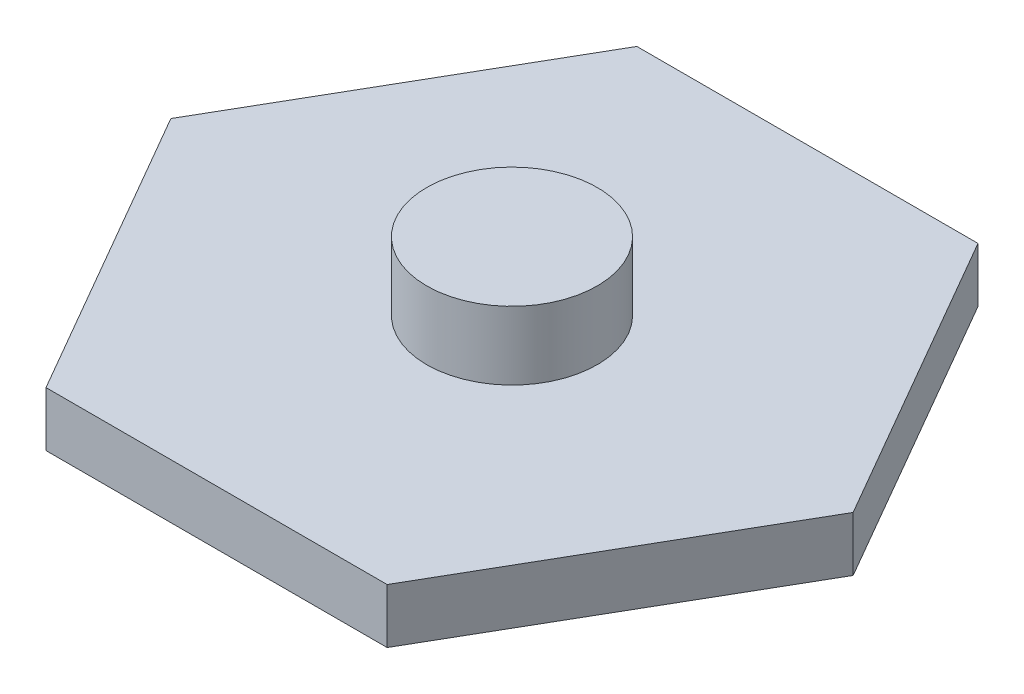
ISO-10303-21;
HEADER;
FILE_DESCRIPTION(('STEP AP214'),'2;1');
FILE_NAME('part.step','',(''),(''),'','','');
FILE_SCHEMA(('AUTOMOTIVE_DESIGN { 1 0 10303 214 1 1 1 1 }'));
ENDSEC;
DATA;
#1=APPLICATION_CONTEXT('core data for automotive mechanical design processes');
#2=APPLICATION_PROTOCOL_DEFINITION('international standard','automotive_design',2000,#1);
#3=PRODUCT_CONTEXT('',#1,'mechanical');
#4=PRODUCT('Part','Part','',(#3));
#5=PRODUCT_RELATED_PRODUCT_CATEGORY('part','',(#4));
#6=PRODUCT_DEFINITION_FORMATION('','',#4);
#7=PRODUCT_DEFINITION_CONTEXT('part definition',#1,'design');
#8=PRODUCT_DEFINITION('design','',#6,#7);
#9=PRODUCT_DEFINITION_SHAPE('','',#8);
#10=(LENGTH_UNIT() NAMED_UNIT(*) SI_UNIT(.MILLI.,.METRE.));
#11=(NAMED_UNIT(*) PLANE_ANGLE_UNIT() SI_UNIT($,.RADIAN.));
#12=(NAMED_UNIT(*) SI_UNIT($,.STERADIAN.) SOLID_ANGLE_UNIT());
#13=UNCERTAINTY_MEASURE_WITH_UNIT(LENGTH_MEASURE(1.E-05),#10,'distance_accuracy_value','');
#14=(GEOMETRIC_REPRESENTATION_CONTEXT(3) GLOBAL_UNCERTAINTY_ASSIGNED_CONTEXT((#13)) GLOBAL_UNIT_ASSIGNED_CONTEXT((#10,
#11,#12)) REPRESENTATION_CONTEXT('',''));
#15=CARTESIAN_POINT('',(0.,0.,0.));
#16=DIRECTION('',(0.,0.,1.));
#17=DIRECTION('',(1.,0.,0.));
#18=AXIS2_PLACEMENT_3D('',#15,#16,#17);
#19=CARTESIAN_POINT('',(5.,1.6,8.66025403784439));
#20=DIRECTION('',(-0.866025403784439,0.,-0.499999999999999));
#21=DIRECTION('',(-0.5,0.,0.866025403784439));
#22=AXIS2_PLACEMENT_3D('',#19,#20,#21);
#23=PLANE('',#22);
#24=DIRECTION('',(0.5,0.,-0.866025403784439));
#25=VECTOR('',#24,1.);
#26=CARTESIAN_POINT('',(5.,0.,8.66025403784439));
#27=LINE('',#26,#25);
#28=CARTESIAN_POINT('',(5.,0.,8.66025403784439));
#29=VERTEX_POINT('',#28);
#30=CARTESIAN_POINT('',(10.,0.,0.));
#31=VERTEX_POINT('',#30);
#32=EDGE_CURVE('E130',#29,#31,#27,.T.);
#33=ORIENTED_EDGE('',*,*,#32,.T.);
#34=DIRECTION('',(0.,-1.,0.));
#35=VECTOR('',#34,1.);
#36=CARTESIAN_POINT('',(10.,1.6,0.));
#37=LINE('',#36,#35);
#38=CARTESIAN_POINT('',(10.,1.6,0.));
#39=VERTEX_POINT('',#38);
#40=EDGE_CURVE('E42',#39,#31,#37,.T.);
#41=ORIENTED_EDGE('',*,*,#40,.F.);
#42=DIRECTION('',(0.5,0.,-0.866025403784439));
#43=VECTOR('',#42,1.);
#44=CARTESIAN_POINT('',(5.,1.6,8.66025403784439));
#45=LINE('',#44,#43);
#46=CARTESIAN_POINT('',(5.,1.6,8.66025403784439));
#47=VERTEX_POINT('',#46);
#48=EDGE_CURVE('E147',#47,#39,#45,.T.);
#49=ORIENTED_EDGE('',*,*,#48,.F.);
#50=DIRECTION('',(0.,-1.,0.));
#51=VECTOR('',#50,1.);
#52=CARTESIAN_POINT('',(5.,1.6,8.66025403784439));
#53=LINE('',#52,#51);
#54=EDGE_CURVE('E126',#47,#29,#53,.T.);
#55=ORIENTED_EDGE('',*,*,#54,.T.);
#56=EDGE_LOOP('',(#33,#41,#49,#55));
#57=FACE_BOUND('',#56,.T.);
#58=ADVANCED_FACE('F39',(#57),#23,.F.);
#59=CARTESIAN_POINT('',(10.,1.6,0.));
#60=DIRECTION('',(-0.866025403784439,0.,0.5));
#61=DIRECTION('',(0.5,0.,0.866025403784439));
#62=AXIS2_PLACEMENT_3D('',#59,#60,#61);
#63=PLANE('',#62);
#64=DIRECTION('',(-0.5,0.,-0.866025403784439));
#65=VECTOR('',#64,1.);
#66=CARTESIAN_POINT('',(10.,0.,0.));
#67=LINE('',#66,#65);
#68=CARTESIAN_POINT('',(5.,0.,-8.66025403784439));
#69=VERTEX_POINT('',#68);
#70=EDGE_CURVE('E134',#31,#69,#67,.T.);
#71=ORIENTED_EDGE('',*,*,#70,.T.);
#72=DIRECTION('',(0.,-1.,0.));
#73=VECTOR('',#72,1.);
#74=CARTESIAN_POINT('',(5.,1.6,-8.66025403784439));
#75=LINE('',#74,#73);
#76=CARTESIAN_POINT('',(5.,1.6,-8.66025403784439));
#77=VERTEX_POINT('',#76);
#78=EDGE_CURVE('E153',#77,#69,#75,.T.);
#79=ORIENTED_EDGE('',*,*,#78,.F.);
#80=DIRECTION('',(-0.5,0.,-0.866025403784439));
#81=VECTOR('',#80,1.);
#82=CARTESIAN_POINT('',(10.,1.6,0.));
#83=LINE('',#82,#81);
#84=EDGE_CURVE('E95',#39,#77,#83,.T.);
#85=ORIENTED_EDGE('',*,*,#84,.F.);
#86=ORIENTED_EDGE('',*,*,#40,.T.);
#87=EDGE_LOOP('',(#71,#79,#85,#86));
#88=FACE_BOUND('',#87,.T.);
#89=ADVANCED_FACE('F160',(#88),#63,.F.);
#90=CARTESIAN_POINT('',(5.,1.6,-8.66025403784439));
#91=DIRECTION('',(0.,0.,1.));
#92=DIRECTION('',(1.,0.,0.));
#93=AXIS2_PLACEMENT_3D('',#90,#91,#92);
#94=PLANE('',#93);
#95=DIRECTION('',(-1.,0.,0.));
#96=VECTOR('',#95,1.);
#97=CARTESIAN_POINT('',(5.,0.,-8.66025403784439));
#98=LINE('',#97,#96);
#99=CARTESIAN_POINT('',(-5.,0.,-8.66025403784439));
#100=VERTEX_POINT('',#99);
#101=EDGE_CURVE('E138',#69,#100,#98,.T.);
#102=ORIENTED_EDGE('',*,*,#101,.T.);
#103=DIRECTION('',(0.,-1.,0.));
#104=VECTOR('',#103,1.);
#105=CARTESIAN_POINT('',(-5.,1.6,-8.66025403784439));
#106=LINE('',#105,#104);
#107=CARTESIAN_POINT('',(-5.,1.6,-8.66025403784439));
#108=VERTEX_POINT('',#107);
#109=EDGE_CURVE('E119',#108,#100,#106,.T.);
#110=ORIENTED_EDGE('',*,*,#109,.F.);
#111=DIRECTION('',(-1.,0.,0.));
#112=VECTOR('',#111,1.);
#113=CARTESIAN_POINT('',(5.,1.6,-8.66025403784439));
#114=LINE('',#113,#112);
#115=EDGE_CURVE('E108',#77,#108,#114,.T.);
#116=ORIENTED_EDGE('',*,*,#115,.F.);
#117=ORIENTED_EDGE('',*,*,#78,.T.);
#118=EDGE_LOOP('',(#102,#110,#116,#117));
#119=FACE_BOUND('',#118,.T.);
#120=ADVANCED_FACE('F166',(#119),#94,.F.);
#121=CARTESIAN_POINT('',(-5.,1.6,-8.66025403784439));
#122=DIRECTION('',(0.866025403784439,0.,0.5));
#123=DIRECTION('',(0.5,0.,-0.866025403784439));
#124=AXIS2_PLACEMENT_3D('',#121,#122,#123);
#125=PLANE('',#124);
#126=DIRECTION('',(-0.5,0.,0.866025403784439));
#127=VECTOR('',#126,1.);
#128=CARTESIAN_POINT('',(-5.,0.,-8.66025403784439));
#129=LINE('',#128,#127);
#130=CARTESIAN_POINT('',(-10.,0.,0.));
#131=VERTEX_POINT('',#130);
#132=EDGE_CURVE('E117',#100,#131,#129,.T.);
#133=ORIENTED_EDGE('',*,*,#132,.T.);
#134=DIRECTION('',(0.,-1.,0.));
#135=VECTOR('',#134,1.);
#136=CARTESIAN_POINT('',(-10.,1.6,0.));
#137=LINE('',#136,#135);
#138=CARTESIAN_POINT('',(-10.,1.6,0.));
#139=VERTEX_POINT('',#138);
#140=EDGE_CURVE('E114',#139,#131,#137,.T.);
#141=ORIENTED_EDGE('',*,*,#140,.F.);
#142=DIRECTION('',(-0.5,0.,0.866025403784439));
#143=VECTOR('',#142,1.);
#144=CARTESIAN_POINT('',(-5.,1.6,-8.66025403784439));
#145=LINE('',#144,#143);
#146=EDGE_CURVE('E102',#108,#139,#145,.T.);
#147=ORIENTED_EDGE('',*,*,#146,.F.);
#148=ORIENTED_EDGE('',*,*,#109,.T.);
#149=EDGE_LOOP('',(#133,#141,#147,#148));
#150=FACE_BOUND('',#149,.T.);
#151=ADVANCED_FACE('F115',(#150),#125,.F.);
#152=CARTESIAN_POINT('',(-10.,1.6,0.));
#153=DIRECTION('',(0.866025403784439,0.,-0.5));
#154=DIRECTION('',(-0.5,0.,-0.866025403784439));
#155=AXIS2_PLACEMENT_3D('',#152,#153,#154);
#156=PLANE('',#155);
#157=DIRECTION('',(0.5,0.,0.866025403784439));
#158=VECTOR('',#157,1.);
#159=CARTESIAN_POINT('',(-10.,0.,0.));
#160=LINE('',#159,#158);
#161=CARTESIAN_POINT('',(-5.,0.,8.66025403784439));
#162=VERTEX_POINT('',#161);
#163=EDGE_CURVE('E80',#131,#162,#160,.T.);
#164=ORIENTED_EDGE('',*,*,#163,.T.);
#165=DIRECTION('',(0.,-1.,0.));
#166=VECTOR('',#165,1.);
#167=CARTESIAN_POINT('',(-5.,1.6,8.66025403784439));
#168=LINE('',#167,#166);
#169=CARTESIAN_POINT('',(-5.,1.6,8.66025403784439));
#170=VERTEX_POINT('',#169);
#171=EDGE_CURVE('E120',#170,#162,#168,.T.);
#172=ORIENTED_EDGE('',*,*,#171,.F.);
#173=DIRECTION('',(0.5,0.,0.866025403784439));
#174=VECTOR('',#173,1.);
#175=CARTESIAN_POINT('',(-10.,1.6,0.));
#176=LINE('',#175,#174);
#177=EDGE_CURVE('E106',#139,#170,#176,.T.);
#178=ORIENTED_EDGE('',*,*,#177,.F.);
#179=ORIENTED_EDGE('',*,*,#140,.T.);
#180=EDGE_LOOP('',(#164,#172,#178,#179));
#181=FACE_BOUND('',#180,.T.);
#182=ADVANCED_FACE('F122',(#181),#156,.F.);
#183=CARTESIAN_POINT('',(-5.,1.6,8.66025403784439));
#184=DIRECTION('',(0.,0.,-1.));
#185=DIRECTION('',(-1.,0.,0.));
#186=AXIS2_PLACEMENT_3D('',#183,#184,#185);
#187=PLANE('',#186);
#188=DIRECTION('',(1.,0.,0.));
#189=VECTOR('',#188,1.);
#190=CARTESIAN_POINT('',(-5.,0.,8.66025403784439));
#191=LINE('',#190,#189);
#192=EDGE_CURVE('E86',#162,#29,#191,.T.);
#193=ORIENTED_EDGE('',*,*,#192,.T.);
#194=ORIENTED_EDGE('',*,*,#54,.F.);
#195=DIRECTION('',(1.,0.,0.));
#196=VECTOR('',#195,1.);
#197=CARTESIAN_POINT('',(-5.,1.6,8.66025403784439));
#198=LINE('',#197,#196);
#199=EDGE_CURVE('E57',#170,#47,#198,.T.);
#200=ORIENTED_EDGE('',*,*,#199,.F.);
#201=ORIENTED_EDGE('',*,*,#171,.T.);
#202=EDGE_LOOP('',(#193,#194,#200,#201));
#203=FACE_BOUND('',#202,.T.);
#204=ADVANCED_FACE('F186',(#203),#187,.F.);
#205=CARTESIAN_POINT('',(0.,1.6,0.));
#206=DIRECTION('',(0.,1.,0.));
#207=DIRECTION('',(0.,0.,1.));
#208=AXIS2_PLACEMENT_3D('',#205,#206,#207);
#209=PLANE('',#208);
#210=CARTESIAN_POINT('',(0.,1.6,0.));
#211=DIRECTION('',(0.,1.,0.));
#212=DIRECTION('',(0.,0.,1.));
#213=AXIS2_PLACEMENT_3D('',#210,#211,#212);
#214=CIRCLE('',#213,2.5);
#215=CARTESIAN_POINT('',(0.,1.6,2.5));
#216=VERTEX_POINT('',#215);
#217=EDGE_CURVE('E11',#216,#216,#214,.T.);
#218=ORIENTED_EDGE('',*,*,#217,.F.);
#219=EDGE_LOOP('',(#218));
#220=FACE_BOUND('',#219,.T.);
#221=ORIENTED_EDGE('',*,*,#48,.T.);
#222=ORIENTED_EDGE('',*,*,#84,.T.);
#223=ORIENTED_EDGE('',*,*,#115,.T.);
#224=ORIENTED_EDGE('',*,*,#146,.T.);
#225=ORIENTED_EDGE('',*,*,#177,.T.);
#226=ORIENTED_EDGE('',*,*,#199,.T.);
#227=EDGE_LOOP('',(#221,#222,#223,#224,#225,#226));
#228=FACE_BOUND('',#227,.T.);
#229=ADVANCED_FACE('F104',(#220,#228),#209,.T.);
#230=CARTESIAN_POINT('',(0.,0.,0.));
#231=DIRECTION('',(0.,1.,0.));
#232=DIRECTION('',(0.,0.,1.));
#233=AXIS2_PLACEMENT_3D('',#230,#231,#232);
#234=PLANE('',#233);
#235=ORIENTED_EDGE('',*,*,#32,.F.);
#236=ORIENTED_EDGE('',*,*,#192,.F.);
#237=ORIENTED_EDGE('',*,*,#163,.F.);
#238=ORIENTED_EDGE('',*,*,#132,.F.);
#239=ORIENTED_EDGE('',*,*,#101,.F.);
#240=ORIENTED_EDGE('',*,*,#70,.F.);
#241=EDGE_LOOP('',(#235,#236,#237,#238,#239,#240));
#242=FACE_BOUND('',#241,.T.);
#243=ADVANCED_FACE('F165',(#242),#234,.F.);
#244=CARTESIAN_POINT('',(0.,3.6,0.));
#245=DIRECTION('',(0.,-1.,0.));
#246=DIRECTION('',(0.,0.,-1.));
#247=AXIS2_PLACEMENT_3D('',#244,#245,#246);
#248=CYLINDRICAL_SURFACE('',#247,2.5);
#249=CARTESIAN_POINT('',(0.,3.6,0.));
#250=DIRECTION('',(0.,1.,0.));
#251=DIRECTION('',(0.,0.,1.));
#252=AXIS2_PLACEMENT_3D('',#249,#250,#251);
#253=CIRCLE('',#252,2.5);
#254=CARTESIAN_POINT('',(0.,3.6,2.5));
#255=VERTEX_POINT('',#254);
#256=EDGE_CURVE('E135',#255,#255,#253,.T.);
#257=ORIENTED_EDGE('',*,*,#256,.F.);
#258=EDGE_LOOP('',(#257));
#259=FACE_BOUND('',#258,.T.);
#260=ORIENTED_EDGE('',*,*,#217,.T.);
#261=EDGE_LOOP('',(#260));
#262=FACE_BOUND('',#261,.T.);
#263=ADVANCED_FACE('F179',(#259,#262),#248,.T.);
#264=CARTESIAN_POINT('',(0.,3.6,0.));
#265=DIRECTION('',(0.,1.,0.));
#266=DIRECTION('',(0.,0.,1.));
#267=AXIS2_PLACEMENT_3D('',#264,#265,#266);
#268=PLANE('',#267);
#269=ORIENTED_EDGE('',*,*,#256,.T.);
#270=EDGE_LOOP('',(#269));
#271=FACE_BOUND('',#270,.T.);
#272=ADVANCED_FACE('F177',(#271),#268,.T.);
#273=CLOSED_SHELL('',(#58,#89,#120,#151,#182,#204,#229,#243,#263,#272));
#274=MANIFOLD_SOLID_BREP('B2',#273);
#275=ADVANCED_BREP_SHAPE_REPRESENTATION('',(#18,#274),#14);
#276=SHAPE_DEFINITION_REPRESENTATION(#9,#275);
ENDSEC;
END-ISO-10303-21;
